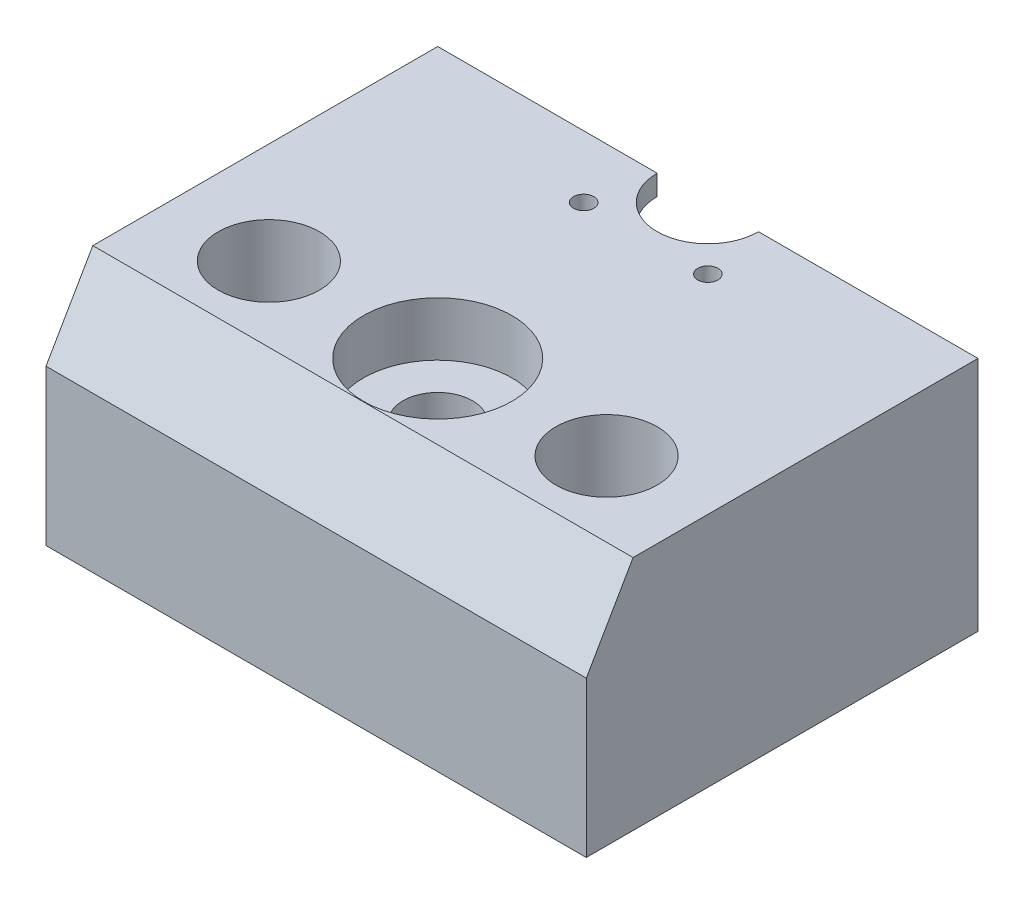
ISO-10303-21;
HEADER;
FILE_DESCRIPTION(('STEP AP214'),'2;1');
FILE_NAME('part.step','',(''),(''),'','','');
FILE_SCHEMA(('AUTOMOTIVE_DESIGN { 1 0 10303 214 1 1 1 1 }'));
ENDSEC;
DATA;
#1=APPLICATION_CONTEXT('core data for automotive mechanical design processes');
#2=APPLICATION_PROTOCOL_DEFINITION('international standard','automotive_design',2000,#1);
#3=PRODUCT_CONTEXT('',#1,'mechanical');
#4=PRODUCT('Part','Part','',(#3));
#5=PRODUCT_RELATED_PRODUCT_CATEGORY('part','',(#4));
#6=PRODUCT_DEFINITION_FORMATION('','',#4);
#7=PRODUCT_DEFINITION_CONTEXT('part definition',#1,'design');
#8=PRODUCT_DEFINITION('design','',#6,#7);
#9=PRODUCT_DEFINITION_SHAPE('','',#8);
#10=(LENGTH_UNIT() NAMED_UNIT(*) SI_UNIT(.MILLI.,.METRE.));
#11=(NAMED_UNIT(*) PLANE_ANGLE_UNIT() SI_UNIT($,.RADIAN.));
#12=(NAMED_UNIT(*) SI_UNIT($,.STERADIAN.) SOLID_ANGLE_UNIT());
#13=UNCERTAINTY_MEASURE_WITH_UNIT(LENGTH_MEASURE(1.E-05),#10,'distance_accuracy_value','');
#14=(GEOMETRIC_REPRESENTATION_CONTEXT(3) GLOBAL_UNCERTAINTY_ASSIGNED_CONTEXT((#13)) GLOBAL_UNIT_ASSIGNED_CONTEXT((#10,
#11,#12)) REPRESENTATION_CONTEXT('',''));
#15=CARTESIAN_POINT('',(0.,0.,0.));
#16=DIRECTION('',(0.,0.,1.));
#17=DIRECTION('',(1.,0.,0.));
#18=AXIS2_PLACEMENT_3D('',#15,#16,#17);
#19=CARTESIAN_POINT('',(0.,0.,40.));
#20=DIRECTION('',(0.,1.,0.));
#21=DIRECTION('',(0.,0.,1.));
#22=AXIS2_PLACEMENT_3D('',#19,#20,#21);
#23=CYLINDRICAL_SURFACE('',#22,5.15);
#24=CARTESIAN_POINT('',(0.,0.,40.));
#25=DIRECTION('',(0.,1.,0.));
#26=DIRECTION('',(0.,0.,1.));
#27=AXIS2_PLACEMENT_3D('',#24,#25,#26);
#28=CIRCLE('',#27,5.15);
#29=CARTESIAN_POINT('',(0.,0.,45.15));
#30=VERTEX_POINT('',#29);
#31=EDGE_CURVE('E142',#30,#30,#28,.T.);
#32=ORIENTED_EDGE('',*,*,#31,.F.);
#33=EDGE_LOOP('',(#32));
#34=FACE_BOUND('',#33,.T.);
#35=CARTESIAN_POINT('',(0.,27.,40.));
#36=DIRECTION('',(0.,1.,0.));
#37=DIRECTION('',(0.,0.,1.));
#38=AXIS2_PLACEMENT_3D('',#35,#36,#37);
#39=CIRCLE('',#38,5.15);
#40=CARTESIAN_POINT('',(0.,27.,45.15));
#41=VERTEX_POINT('',#40);
#42=EDGE_CURVE('E37',#41,#41,#39,.F.);
#43=ORIENTED_EDGE('',*,*,#42,.F.);
#44=EDGE_LOOP('',(#43));
#45=FACE_BOUND('',#44,.T.);
#46=ADVANCED_FACE('F33',(#34,#45),#23,.F.);
#47=CARTESIAN_POINT('',(0.,35.,0.));
#48=DIRECTION('',(0.,-1.,0.));
#49=DIRECTION('',(0.,0.,-1.));
#50=AXIS2_PLACEMENT_3D('',#47,#48,#49);
#51=CYLINDRICAL_SURFACE('',#50,19.15);
#52=DIRECTION('',(0.,-1.,0.));
#53=VECTOR('',#52,1.);
#54=CARTESIAN_POINT('',(-19.15,35.,0.));
#55=LINE('',#54,#53);
#56=CARTESIAN_POINT('',(-19.15,32.,0.));
#57=VERTEX_POINT('',#56);
#58=CARTESIAN_POINT('',(-19.15,0.,0.));
#59=VERTEX_POINT('',#58);
#60=EDGE_CURVE('E189',#57,#59,#55,.T.);
#61=ORIENTED_EDGE('',*,*,#60,.F.);
#62=CARTESIAN_POINT('',(0.,32.,0.));
#63=DIRECTION('',(0.,1.,0.));
#64=DIRECTION('',(0.,0.,1.));
#65=AXIS2_PLACEMENT_3D('',#62,#63,#64);
#66=CIRCLE('',#65,19.15);
#67=CARTESIAN_POINT('',(19.15,32.,0.));
#68=VERTEX_POINT('',#67);
#69=EDGE_CURVE('E123',#57,#68,#66,.T.);
#70=ORIENTED_EDGE('',*,*,#69,.T.);
#71=DIRECTION('',(0.,-1.,0.));
#72=VECTOR('',#71,1.);
#73=CARTESIAN_POINT('',(19.15,35.,0.));
#74=LINE('',#73,#72);
#75=CARTESIAN_POINT('',(19.15,0.,0.));
#76=VERTEX_POINT('',#75);
#77=EDGE_CURVE('E163',#68,#76,#74,.T.);
#78=ORIENTED_EDGE('',*,*,#77,.T.);
#79=CARTESIAN_POINT('',(0.,0.,0.));
#80=DIRECTION('',(0.,-1.,0.));
#81=DIRECTION('',(0.,0.,1.));
#82=AXIS2_PLACEMENT_3D('',#79,#80,#81);
#83=CIRCLE('',#82,19.15);
#84=EDGE_CURVE('E153',#76,#59,#83,.T.);
#85=ORIENTED_EDGE('',*,*,#84,.T.);
#86=EDGE_LOOP('',(#61,#70,#78,#85));
#87=FACE_BOUND('',#86,.T.);
#88=ADVANCED_FACE('F226',(#87),#51,.F.);
#89=CARTESIAN_POINT('',(-40.,35.,0.));
#90=DIRECTION('',(0.,0.,1.));
#91=DIRECTION('',(1.,0.,0.));
#92=AXIS2_PLACEMENT_3D('',#89,#90,#91);
#93=PLANE('',#92);
#94=DIRECTION('',(-1.,0.,0.));
#95=VECTOR('',#94,1.);
#96=CARTESIAN_POINT('',(-40.,0.,0.));
#97=LINE('',#96,#95);
#98=CARTESIAN_POINT('',(-40.,0.,0.));
#99=VERTEX_POINT('',#98);
#100=EDGE_CURVE('E166',#59,#99,#97,.T.);
#101=ORIENTED_EDGE('',*,*,#100,.T.);
#102=DIRECTION('',(0.,-1.,0.));
#103=VECTOR('',#102,1.);
#104=CARTESIAN_POINT('',(-40.,35.,0.));
#105=LINE('',#104,#103);
#106=CARTESIAN_POINT('',(-40.,35.,0.));
#107=VERTEX_POINT('',#106);
#108=EDGE_CURVE('E186',#107,#99,#105,.T.);
#109=ORIENTED_EDGE('',*,*,#108,.F.);
#110=DIRECTION('',(-1.,0.,0.));
#111=VECTOR('',#110,1.);
#112=CARTESIAN_POINT('',(-40.,35.,0.));
#113=LINE('',#112,#111);
#114=CARTESIAN_POINT('',(-7.5,35.,0.));
#115=VERTEX_POINT('',#114);
#116=EDGE_CURVE('E109',#115,#107,#113,.T.);
#117=ORIENTED_EDGE('',*,*,#116,.F.);
#118=DIRECTION('',(0.,1.,0.));
#119=VECTOR('',#118,1.);
#120=CARTESIAN_POINT('',(-7.5,32.,0.));
#121=LINE('',#120,#119);
#122=CARTESIAN_POINT('',(-7.5,32.,0.));
#123=VERTEX_POINT('',#122);
#124=EDGE_CURVE('E103',#123,#115,#121,.T.);
#125=ORIENTED_EDGE('',*,*,#124,.F.);
#126=DIRECTION('',(-1.,0.,0.));
#127=VECTOR('',#126,1.);
#128=CARTESIAN_POINT('',(-19.15,32.,0.));
#129=LINE('',#128,#127);
#130=EDGE_CURVE('E106',#123,#57,#129,.T.);
#131=ORIENTED_EDGE('',*,*,#130,.T.);
#132=ORIENTED_EDGE('',*,*,#60,.T.);
#133=EDGE_LOOP('',(#101,#109,#117,#125,#131,#132));
#134=FACE_BOUND('',#133,.T.);
#135=ADVANCED_FACE('F105',(#134),#93,.F.);
#136=CARTESIAN_POINT('',(-40.,35.,0.));
#137=DIRECTION('',(1.,0.,0.));
#138=DIRECTION('',(0.,0.,-1.));
#139=AXIS2_PLACEMENT_3D('',#136,#137,#138);
#140=PLANE('',#139);
#141=DIRECTION('',(0.,-1.,0.));
#142=VECTOR('',#141,1.);
#143=CARTESIAN_POINT('',(-40.,35.,58.));
#144=LINE('',#143,#142);
#145=CARTESIAN_POINT('',(-40.,23.,58.));
#146=VERTEX_POINT('',#145);
#147=CARTESIAN_POINT('',(-40.,0.,58.));
#148=VERTEX_POINT('',#147);
#149=EDGE_CURVE('E184',#146,#148,#144,.T.);
#150=ORIENTED_EDGE('',*,*,#149,.F.);
#151=DIRECTION('',(0.,0.86602540378444,-0.499999999999998));
#152=VECTOR('',#151,1.);
#153=CARTESIAN_POINT('',(-40.,35.,51.0717967697245));
#154=LINE('',#153,#152);
#155=CARTESIAN_POINT('',(-40.,35.,51.0717967697245));
#156=VERTEX_POINT('',#155);
#157=EDGE_CURVE('E11',#146,#156,#154,.T.);
#158=ORIENTED_EDGE('',*,*,#157,.T.);
#159=DIRECTION('',(0.,0.,1.));
#160=VECTOR('',#159,1.);
#161=CARTESIAN_POINT('',(-40.,35.,0.));
#162=LINE('',#161,#160);
#163=EDGE_CURVE('E155',#107,#156,#162,.T.);
#164=ORIENTED_EDGE('',*,*,#163,.F.);
#165=ORIENTED_EDGE('',*,*,#108,.T.);
#166=DIRECTION('',(0.,0.,1.));
#167=VECTOR('',#166,1.);
#168=CARTESIAN_POINT('',(-40.,0.,0.));
#169=LINE('',#168,#167);
#170=EDGE_CURVE('E168',#99,#148,#169,.T.);
#171=ORIENTED_EDGE('',*,*,#170,.T.);
#172=EDGE_LOOP('',(#150,#158,#164,#165,#171));
#173=FACE_BOUND('',#172,.T.);
#174=ADVANCED_FACE('F211',(#173),#140,.F.);
#175=CARTESIAN_POINT('',(-40.,35.,58.));
#176=DIRECTION('',(0.,0.,-1.));
#177=DIRECTION('',(-1.,0.,0.));
#178=AXIS2_PLACEMENT_3D('',#175,#176,#177);
#179=PLANE('',#178);
#180=DIRECTION('',(0.,-1.,0.));
#181=VECTOR('',#180,1.);
#182=CARTESIAN_POINT('',(40.,35.,58.));
#183=LINE('',#182,#181);
#184=CARTESIAN_POINT('',(40.,23.,58.));
#185=VERTEX_POINT('',#184);
#186=CARTESIAN_POINT('',(40.,0.,58.));
#187=VERTEX_POINT('',#186);
#188=EDGE_CURVE('E182',#185,#187,#183,.T.);
#189=ORIENTED_EDGE('',*,*,#188,.F.);
#190=DIRECTION('',(-1.,0.,0.));
#191=VECTOR('',#190,1.);
#192=CARTESIAN_POINT('',(-40.,23.,58.));
#193=LINE('',#192,#191);
#194=EDGE_CURVE('E42',#185,#146,#193,.T.);
#195=ORIENTED_EDGE('',*,*,#194,.T.);
#196=ORIENTED_EDGE('',*,*,#149,.T.);
#197=DIRECTION('',(1.,0.,0.));
#198=VECTOR('',#197,1.);
#199=CARTESIAN_POINT('',(-40.,0.,58.));
#200=LINE('',#199,#198);
#201=EDGE_CURVE('E171',#148,#187,#200,.T.);
#202=ORIENTED_EDGE('',*,*,#201,.T.);
#203=EDGE_LOOP('',(#189,#195,#196,#202));
#204=FACE_BOUND('',#203,.T.);
#205=ADVANCED_FACE('F251',(#204),#179,.F.);
#206=CARTESIAN_POINT('',(40.,35.,0.));
#207=DIRECTION('',(-1.,0.,0.));
#208=DIRECTION('',(0.,0.,1.));
#209=AXIS2_PLACEMENT_3D('',#206,#207,#208);
#210=PLANE('',#209);
#211=DIRECTION('',(0.,0.,-1.));
#212=VECTOR('',#211,1.);
#213=CARTESIAN_POINT('',(40.,35.,0.));
#214=LINE('',#213,#212);
#215=CARTESIAN_POINT('',(40.,35.,51.0717967697245));
#216=VERTEX_POINT('',#215);
#217=CARTESIAN_POINT('',(40.,35.,0.));
#218=VERTEX_POINT('',#217);
#219=EDGE_CURVE('E159',#216,#218,#214,.T.);
#220=ORIENTED_EDGE('',*,*,#219,.F.);
#221=DIRECTION('',(0.,-0.86602540378444,0.499999999999998));
#222=VECTOR('',#221,1.);
#223=CARTESIAN_POINT('',(40.,35.,51.0717967697245));
#224=LINE('',#223,#222);
#225=EDGE_CURVE('E56',#216,#185,#224,.T.);
#226=ORIENTED_EDGE('',*,*,#225,.T.);
#227=ORIENTED_EDGE('',*,*,#188,.T.);
#228=DIRECTION('',(0.,0.,-1.));
#229=VECTOR('',#228,1.);
#230=CARTESIAN_POINT('',(40.,0.,0.));
#231=LINE('',#230,#229);
#232=CARTESIAN_POINT('',(40.,0.,0.));
#233=VERTEX_POINT('',#232);
#234=EDGE_CURVE('E174',#187,#233,#231,.T.);
#235=ORIENTED_EDGE('',*,*,#234,.T.);
#236=DIRECTION('',(0.,-1.,0.));
#237=VECTOR('',#236,1.);
#238=CARTESIAN_POINT('',(40.,35.,0.));
#239=LINE('',#238,#237);
#240=EDGE_CURVE('E179',#218,#233,#239,.T.);
#241=ORIENTED_EDGE('',*,*,#240,.F.);
#242=EDGE_LOOP('',(#220,#226,#227,#235,#241));
#243=FACE_BOUND('',#242,.T.);
#244=ADVANCED_FACE('F202',(#243),#210,.F.);
#245=CARTESIAN_POINT('',(19.15,35.,0.));
#246=DIRECTION('',(0.,0.,1.));
#247=DIRECTION('',(1.,0.,0.));
#248=AXIS2_PLACEMENT_3D('',#245,#246,#247);
#249=PLANE('',#248);
#250=DIRECTION('',(-1.,0.,0.));
#251=VECTOR('',#250,1.);
#252=CARTESIAN_POINT('',(19.15,0.,0.));
#253=LINE('',#252,#251);
#254=EDGE_CURVE('E156',#233,#76,#253,.T.);
#255=ORIENTED_EDGE('',*,*,#254,.T.);
#256=ORIENTED_EDGE('',*,*,#77,.F.);
#257=DIRECTION('',(-1.,0.,0.));
#258=VECTOR('',#257,1.);
#259=CARTESIAN_POINT('',(7.5,32.,0.));
#260=LINE('',#259,#258);
#261=CARTESIAN_POINT('',(7.5,32.,0.));
#262=VERTEX_POINT('',#261);
#263=EDGE_CURVE('E115',#68,#262,#260,.T.);
#264=ORIENTED_EDGE('',*,*,#263,.T.);
#265=DIRECTION('',(0.,1.,0.));
#266=VECTOR('',#265,1.);
#267=CARTESIAN_POINT('',(7.5,32.,0.));
#268=LINE('',#267,#266);
#269=CARTESIAN_POINT('',(7.5,35.,0.));
#270=VERTEX_POINT('',#269);
#271=EDGE_CURVE('E114',#262,#270,#268,.T.);
#272=ORIENTED_EDGE('',*,*,#271,.T.);
#273=DIRECTION('',(-1.,0.,0.));
#274=VECTOR('',#273,1.);
#275=CARTESIAN_POINT('',(19.15,35.,0.));
#276=LINE('',#275,#274);
#277=EDGE_CURVE('E161',#218,#270,#276,.T.);
#278=ORIENTED_EDGE('',*,*,#277,.F.);
#279=ORIENTED_EDGE('',*,*,#240,.T.);
#280=EDGE_LOOP('',(#255,#256,#264,#272,#278,#279));
#281=FACE_BOUND('',#280,.T.);
#282=ADVANCED_FACE('F207',(#281),#249,.F.);
#283=CARTESIAN_POINT('',(0.,35.,0.));
#284=DIRECTION('',(0.,1.,0.));
#285=DIRECTION('',(0.,0.,1.));
#286=AXIS2_PLACEMENT_3D('',#283,#284,#285);
#287=PLANE('',#286);
#288=CARTESIAN_POINT('',(0.,35.,40.));
#289=DIRECTION('',(0.,1.,0.));
#290=DIRECTION('',(0.,0.,1.));
#291=AXIS2_PLACEMENT_3D('',#288,#289,#290);
#292=CIRCLE('',#291,11.);
#293=CARTESIAN_POINT('',(0.,35.,51.));
#294=VERTEX_POINT('',#293);
#295=EDGE_CURVE('E356',#294,#294,#292,.T.);
#296=ORIENTED_EDGE('',*,*,#295,.F.);
#297=EDGE_LOOP('',(#296));
#298=FACE_BOUND('',#297,.T.);
#299=CARTESIAN_POINT('',(9.1923881554251,35.,9.19238815542514));
#300=DIRECTION('',(0.,-1.,0.));
#301=DIRECTION('',(0.,0.,-1.));
#302=AXIS2_PLACEMENT_3D('',#299,#300,#301);
#303=CIRCLE('',#302,1.5);
#304=CARTESIAN_POINT('',(9.1923881554251,35.,7.69238815542513));
#305=VERTEX_POINT('',#304);
#306=EDGE_CURVE('E129',#305,#305,#303,.T.);
#307=ORIENTED_EDGE('',*,*,#306,.T.);
#308=EDGE_LOOP('',(#307));
#309=FACE_BOUND('',#308,.T.);
#310=CARTESIAN_POINT('',(-9.1923881554251,35.,9.19238815542514));
#311=DIRECTION('',(0.,-1.,0.));
#312=DIRECTION('',(0.,0.,1.));
#313=AXIS2_PLACEMENT_3D('',#310,#311,#312);
#314=CIRCLE('',#313,1.5);
#315=CARTESIAN_POINT('',(-9.1923881554251,35.,10.6923881554251));
#316=VERTEX_POINT('',#315);
#317=EDGE_CURVE('E364',#316,#316,#314,.T.);
#318=ORIENTED_EDGE('',*,*,#317,.T.);
#319=EDGE_LOOP('',(#318));
#320=FACE_BOUND('',#319,.T.);
#321=CARTESIAN_POINT('',(25.,35.,40.));
#322=DIRECTION('',(0.,1.,0.));
#323=DIRECTION('',(0.,0.,-1.));
#324=AXIS2_PLACEMENT_3D('',#321,#322,#323);
#325=CIRCLE('',#324,7.5);
#326=CARTESIAN_POINT('',(25.,35.,32.5));
#327=VERTEX_POINT('',#326);
#328=EDGE_CURVE('E137',#327,#327,#325,.T.);
#329=ORIENTED_EDGE('',*,*,#328,.F.);
#330=EDGE_LOOP('',(#329));
#331=FACE_BOUND('',#330,.T.);
#332=CARTESIAN_POINT('',(-25.,35.,40.));
#333=DIRECTION('',(0.,1.,0.));
#334=DIRECTION('',(0.,0.,1.));
#335=AXIS2_PLACEMENT_3D('',#332,#333,#334);
#336=CIRCLE('',#335,7.5);
#337=CARTESIAN_POINT('',(-25.,35.,47.5));
#338=VERTEX_POINT('',#337);
#339=EDGE_CURVE('E143',#338,#338,#336,.T.);
#340=ORIENTED_EDGE('',*,*,#339,.F.);
#341=EDGE_LOOP('',(#340));
#342=FACE_BOUND('',#341,.T.);
#343=ORIENTED_EDGE('',*,*,#163,.T.);
#344=DIRECTION('',(1.,0.,0.));
#345=VECTOR('',#344,1.);
#346=CARTESIAN_POINT('',(40.,35.,51.0717967697245));
#347=LINE('',#346,#345);
#348=EDGE_CURVE('E191',#156,#216,#347,.T.);
#349=ORIENTED_EDGE('',*,*,#348,.T.);
#350=ORIENTED_EDGE('',*,*,#219,.T.);
#351=ORIENTED_EDGE('',*,*,#277,.T.);
#352=CARTESIAN_POINT('',(0.,35.,0.));
#353=DIRECTION('',(0.,-1.,0.));
#354=DIRECTION('',(0.,0.,-1.));
#355=AXIS2_PLACEMENT_3D('',#352,#353,#354);
#356=CIRCLE('',#355,7.5);
#357=EDGE_CURVE('E127',#270,#115,#356,.T.);
#358=ORIENTED_EDGE('',*,*,#357,.T.);
#359=ORIENTED_EDGE('',*,*,#116,.T.);
#360=EDGE_LOOP('',(#343,#349,#350,#351,#358,#359));
#361=FACE_BOUND('',#360,.T.);
#362=ADVANCED_FACE('F197',(#298,#309,#320,#331,#342,#361),#287,.T.);
#363=CARTESIAN_POINT('',(0.,0.,0.));
#364=DIRECTION('',(0.,1.,0.));
#365=DIRECTION('',(0.,0.,1.));
#366=AXIS2_PLACEMENT_3D('',#363,#364,#365);
#367=PLANE('',#366);
#368=CARTESIAN_POINT('',(25.,0.,40.));
#369=DIRECTION('',(0.,1.,0.));
#370=DIRECTION('',(0.,0.,-1.));
#371=AXIS2_PLACEMENT_3D('',#368,#369,#370);
#372=CIRCLE('',#371,7.5);
#373=CARTESIAN_POINT('',(25.,0.,32.5));
#374=VERTEX_POINT('',#373);
#375=EDGE_CURVE('E146',#374,#374,#372,.T.);
#376=ORIENTED_EDGE('',*,*,#375,.T.);
#377=EDGE_LOOP('',(#376));
#378=FACE_BOUND('',#377,.T.);
#379=CARTESIAN_POINT('',(-25.,0.,40.));
#380=DIRECTION('',(0.,1.,0.));
#381=DIRECTION('',(0.,0.,1.));
#382=AXIS2_PLACEMENT_3D('',#379,#380,#381);
#383=CIRCLE('',#382,7.5);
#384=CARTESIAN_POINT('',(-25.,0.,47.5));
#385=VERTEX_POINT('',#384);
#386=EDGE_CURVE('E139',#385,#385,#383,.T.);
#387=ORIENTED_EDGE('',*,*,#386,.T.);
#388=EDGE_LOOP('',(#387));
#389=FACE_BOUND('',#388,.T.);
#390=ORIENTED_EDGE('',*,*,#31,.T.);
#391=EDGE_LOOP('',(#390));
#392=FACE_BOUND('',#391,.T.);
#393=ORIENTED_EDGE('',*,*,#84,.F.);
#394=ORIENTED_EDGE('',*,*,#254,.F.);
#395=ORIENTED_EDGE('',*,*,#234,.F.);
#396=ORIENTED_EDGE('',*,*,#201,.F.);
#397=ORIENTED_EDGE('',*,*,#170,.F.);
#398=ORIENTED_EDGE('',*,*,#100,.F.);
#399=EDGE_LOOP('',(#393,#394,#395,#396,#397,#398));
#400=FACE_BOUND('',#399,.T.);
#401=ADVANCED_FACE('F241',(#378,#389,#392,#400),#367,.F.);
#402=CARTESIAN_POINT('',(-25.,0.,40.));
#403=DIRECTION('',(0.,1.,0.));
#404=DIRECTION('',(0.,0.,1.));
#405=AXIS2_PLACEMENT_3D('',#402,#403,#404);
#406=CYLINDRICAL_SURFACE('',#405,7.5);
#407=ORIENTED_EDGE('',*,*,#386,.F.);
#408=EDGE_LOOP('',(#407));
#409=FACE_BOUND('',#408,.T.);
#410=ORIENTED_EDGE('',*,*,#339,.T.);
#411=EDGE_LOOP('',(#410));
#412=FACE_BOUND('',#411,.T.);
#413=ADVANCED_FACE('F245',(#409,#412),#406,.F.);
#414=CARTESIAN_POINT('',(25.,0.,40.));
#415=DIRECTION('',(0.,1.,0.));
#416=DIRECTION('',(0.,0.,1.));
#417=AXIS2_PLACEMENT_3D('',#414,#415,#416);
#418=CYLINDRICAL_SURFACE('',#417,7.5);
#419=ORIENTED_EDGE('',*,*,#375,.F.);
#420=EDGE_LOOP('',(#419));
#421=FACE_BOUND('',#420,.T.);
#422=ORIENTED_EDGE('',*,*,#328,.T.);
#423=EDGE_LOOP('',(#422));
#424=FACE_BOUND('',#423,.T.);
#425=ADVANCED_FACE('F237',(#421,#424),#418,.F.);
#426=CARTESIAN_POINT('',(0.,32.,0.));
#427=DIRECTION('',(0.,1.,0.));
#428=DIRECTION('',(0.,0.,1.));
#429=AXIS2_PLACEMENT_3D('',#426,#427,#428);
#430=CYLINDRICAL_SURFACE('',#429,7.5);
#431=ORIENTED_EDGE('',*,*,#357,.F.);
#432=ORIENTED_EDGE('',*,*,#271,.F.);
#433=CARTESIAN_POINT('',(0.,32.,0.));
#434=DIRECTION('',(0.,-1.,0.));
#435=DIRECTION('',(0.,0.,-1.));
#436=AXIS2_PLACEMENT_3D('',#433,#434,#435);
#437=CIRCLE('',#436,7.5);
#438=EDGE_CURVE('E120',#262,#123,#437,.T.);
#439=ORIENTED_EDGE('',*,*,#438,.T.);
#440=ORIENTED_EDGE('',*,*,#124,.T.);
#441=EDGE_LOOP('',(#431,#432,#439,#440));
#442=FACE_BOUND('',#441,.T.);
#443=ADVANCED_FACE('F125',(#442),#430,.F.);
#444=CARTESIAN_POINT('',(0.,32.,0.));
#445=DIRECTION('',(0.,-1.,0.));
#446=DIRECTION('',(0.,0.,-1.));
#447=AXIS2_PLACEMENT_3D('',#444,#445,#446);
#448=PLANE('',#447);
#449=CARTESIAN_POINT('',(9.1923881554251,32.,9.19238815542514));
#450=DIRECTION('',(0.,-1.,0.));
#451=DIRECTION('',(0.,0.,-1.));
#452=AXIS2_PLACEMENT_3D('',#449,#450,#451);
#453=CIRCLE('',#452,1.5);
#454=CARTESIAN_POINT('',(9.1923881554251,32.,7.69238815542513));
#455=VERTEX_POINT('',#454);
#456=EDGE_CURVE('E362',#455,#455,#453,.T.);
#457=ORIENTED_EDGE('',*,*,#456,.F.);
#458=EDGE_LOOP('',(#457));
#459=FACE_BOUND('',#458,.T.);
#460=CARTESIAN_POINT('',(-9.1923881554251,32.,9.19238815542514));
#461=DIRECTION('',(0.,-1.,0.));
#462=DIRECTION('',(0.,0.,1.));
#463=AXIS2_PLACEMENT_3D('',#460,#461,#462);
#464=CIRCLE('',#463,1.5);
#465=CARTESIAN_POINT('',(-9.1923881554251,32.,10.6923881554251));
#466=VERTEX_POINT('',#465);
#467=EDGE_CURVE('E132',#466,#466,#464,.T.);
#468=ORIENTED_EDGE('',*,*,#467,.F.);
#469=EDGE_LOOP('',(#468));
#470=FACE_BOUND('',#469,.T.);
#471=ORIENTED_EDGE('',*,*,#438,.F.);
#472=ORIENTED_EDGE('',*,*,#263,.F.);
#473=ORIENTED_EDGE('',*,*,#69,.F.);
#474=ORIENTED_EDGE('',*,*,#130,.F.);
#475=EDGE_LOOP('',(#471,#472,#473,#474));
#476=FACE_BOUND('',#475,.T.);
#477=ADVANCED_FACE('F119',(#459,#470,#476),#448,.T.);
#478=CARTESIAN_POINT('',(-9.1923881554251,35.,9.19238815542514));
#479=DIRECTION('',(0.,-1.,0.));
#480=DIRECTION('',(0.,0.,-1.));
#481=AXIS2_PLACEMENT_3D('',#478,#479,#480);
#482=CYLINDRICAL_SURFACE('',#481,1.5);
#483=ORIENTED_EDGE('',*,*,#317,.F.);
#484=EDGE_LOOP('',(#483));
#485=FACE_BOUND('',#484,.T.);
#486=ORIENTED_EDGE('',*,*,#467,.T.);
#487=EDGE_LOOP('',(#486));
#488=FACE_BOUND('',#487,.T.);
#489=ADVANCED_FACE('F222',(#485,#488),#482,.F.);
#490=CARTESIAN_POINT('',(9.1923881554251,35.,9.19238815542514));
#491=DIRECTION('',(0.,-1.,0.));
#492=DIRECTION('',(0.,0.,-1.));
#493=AXIS2_PLACEMENT_3D('',#490,#491,#492);
#494=CYLINDRICAL_SURFACE('',#493,1.5);
#495=ORIENTED_EDGE('',*,*,#306,.F.);
#496=EDGE_LOOP('',(#495));
#497=FACE_BOUND('',#496,.T.);
#498=ORIENTED_EDGE('',*,*,#456,.T.);
#499=EDGE_LOOP('',(#498));
#500=FACE_BOUND('',#499,.T.);
#501=ADVANCED_FACE('F214',(#497,#500),#494,.F.);
#502=CARTESIAN_POINT('',(0.,35.,51.0717967697245));
#503=DIRECTION('',(0.,0.499999999999998,0.86602540378444));
#504=DIRECTION('',(-1.,0.,0.));
#505=AXIS2_PLACEMENT_3D('',#502,#503,#504);
#506=PLANE('',#505);
#507=ORIENTED_EDGE('',*,*,#157,.F.);
#508=ORIENTED_EDGE('',*,*,#194,.F.);
#509=ORIENTED_EDGE('',*,*,#225,.F.);
#510=ORIENTED_EDGE('',*,*,#348,.F.);
#511=EDGE_LOOP('',(#507,#508,#509,#510));
#512=FACE_BOUND('',#511,.T.);
#513=ADVANCED_FACE('F35',(#512),#506,.T.);
#514=CARTESIAN_POINT('',(0.,27.,40.));
#515=DIRECTION('',(0.,1.,0.));
#516=DIRECTION('',(0.,0.,1.));
#517=AXIS2_PLACEMENT_3D('',#514,#515,#516);
#518=PLANE('',#517);
#519=CARTESIAN_POINT('',(0.,27.,40.));
#520=DIRECTION('',(0.,1.,0.));
#521=DIRECTION('',(0.,0.,1.));
#522=AXIS2_PLACEMENT_3D('',#519,#520,#521);
#523=CIRCLE('',#522,11.);
#524=CARTESIAN_POINT('',(0.,27.,51.));
#525=VERTEX_POINT('',#524);
#526=EDGE_CURVE('E353',#525,#525,#523,.T.);
#527=ORIENTED_EDGE('',*,*,#526,.T.);
#528=EDGE_LOOP('',(#527));
#529=FACE_BOUND('',#528,.T.);
#530=ORIENTED_EDGE('',*,*,#42,.T.);
#531=EDGE_LOOP('',(#530));
#532=FACE_BOUND('',#531,.T.);
#533=ADVANCED_FACE('F213',(#529,#532),#518,.T.);
#534=CARTESIAN_POINT('',(0.,27.,40.));
#535=DIRECTION('',(0.,1.,0.));
#536=DIRECTION('',(0.,0.,1.));
#537=AXIS2_PLACEMENT_3D('',#534,#535,#536);
#538=CYLINDRICAL_SURFACE('',#537,11.);
#539=ORIENTED_EDGE('',*,*,#526,.F.);
#540=EDGE_LOOP('',(#539));
#541=FACE_BOUND('',#540,.T.);
#542=ORIENTED_EDGE('',*,*,#295,.T.);
#543=EDGE_LOOP('',(#542));
#544=FACE_BOUND('',#543,.T.);
#545=ADVANCED_FACE('F219',(#541,#544),#538,.F.);
#546=CLOSED_SHELL('',(#46,#88,#135,#174,#205,#244,#282,#362,#401,#413,#425,#443,#477,#489,#501,
#513,#533,#545));
#547=MANIFOLD_SOLID_BREP('B2',#546);
#548=ADVANCED_BREP_SHAPE_REPRESENTATION('',(#18,#547),#14);
#549=SHAPE_DEFINITION_REPRESENTATION(#9,#548);
ENDSEC;
END-ISO-10303-21;
